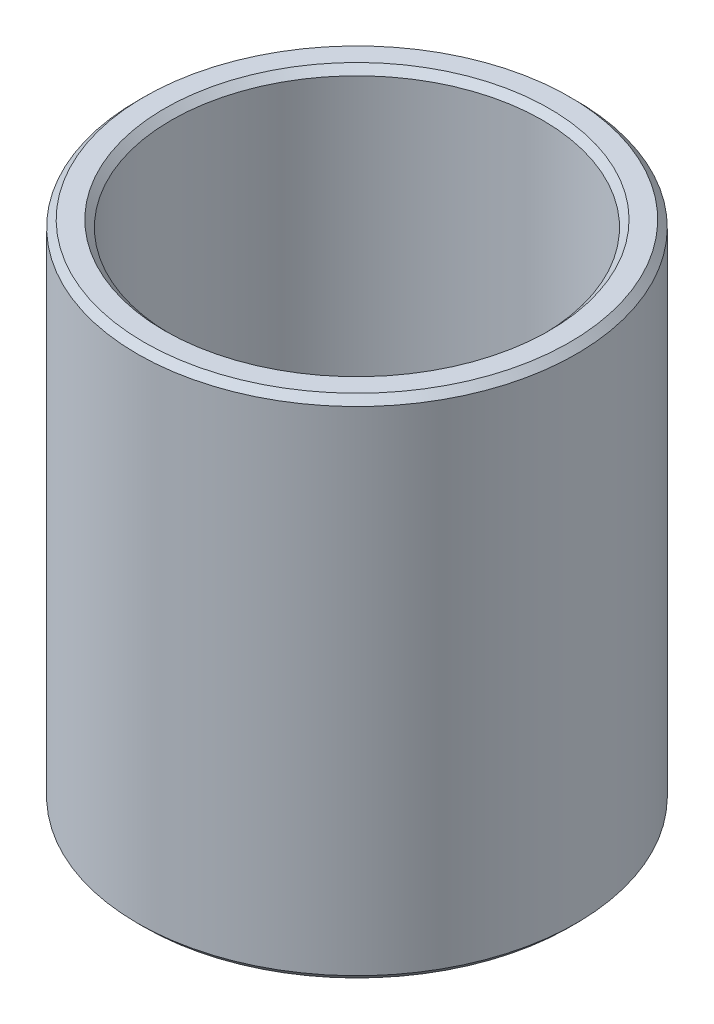
ISO-10303-21;
HEADER;
FILE_DESCRIPTION(('STEP AP214'),'2;1');
FILE_NAME('part.step','',(''),(''),'','','');
FILE_SCHEMA(('AUTOMOTIVE_DESIGN { 1 0 10303 214 1 1 1 1 }'));
ENDSEC;
DATA;
#1=APPLICATION_CONTEXT('core data for automotive mechanical design processes');
#2=APPLICATION_PROTOCOL_DEFINITION('international standard','automotive_design',2000,#1);
#3=PRODUCT_CONTEXT('',#1,'mechanical');
#4=PRODUCT('Part','Part','',(#3));
#5=PRODUCT_RELATED_PRODUCT_CATEGORY('part','',(#4));
#6=PRODUCT_DEFINITION_FORMATION('','',#4);
#7=PRODUCT_DEFINITION_CONTEXT('part definition',#1,'design');
#8=PRODUCT_DEFINITION('design','',#6,#7);
#9=PRODUCT_DEFINITION_SHAPE('','',#8);
#10=(LENGTH_UNIT() NAMED_UNIT(*) SI_UNIT(.MILLI.,.METRE.));
#11=(NAMED_UNIT(*) PLANE_ANGLE_UNIT() SI_UNIT($,.RADIAN.));
#12=(NAMED_UNIT(*) SI_UNIT($,.STERADIAN.) SOLID_ANGLE_UNIT());
#13=UNCERTAINTY_MEASURE_WITH_UNIT(LENGTH_MEASURE(1.E-05),#10,'distance_accuracy_value','');
#14=(GEOMETRIC_REPRESENTATION_CONTEXT(3) GLOBAL_UNCERTAINTY_ASSIGNED_CONTEXT((#13)) GLOBAL_UNIT_ASSIGNED_CONTEXT((#10,
#11,#12)) REPRESENTATION_CONTEXT('',''));
#15=CARTESIAN_POINT('',(0.,0.,0.));
#16=DIRECTION('',(0.,0.,1.));
#17=DIRECTION('',(1.,0.,0.));
#18=AXIS2_PLACEMENT_3D('',#15,#16,#17);
#19=CARTESIAN_POINT('',(0.,15.,0.));
#20=DIRECTION('',(0.,-1.,0.));
#21=DIRECTION('',(0.,0.,-1.));
#22=AXIS2_PLACEMENT_3D('',#19,#20,#21);
#23=CYLINDRICAL_SURFACE('',#22,5.5);
#24=CARTESIAN_POINT('',(0.,0.200000000000001,0.));
#25=DIRECTION('',(0.,1.,0.));
#26=DIRECTION('',(0.,0.,1.));
#27=AXIS2_PLACEMENT_3D('',#24,#25,#26);
#28=CIRCLE('',#27,5.5);
#29=CARTESIAN_POINT('',(0.,0.200000000000001,5.5));
#30=VERTEX_POINT('',#29);
#31=EDGE_CURVE('E42',#30,#30,#28,.F.);
#32=ORIENTED_EDGE('',*,*,#31,.T.);
#33=EDGE_LOOP('',(#32));
#34=FACE_BOUND('',#33,.T.);
#35=CARTESIAN_POINT('',(0.,14.8,0.));
#36=DIRECTION('',(0.,1.,0.));
#37=DIRECTION('',(0.,0.,1.));
#38=AXIS2_PLACEMENT_3D('',#35,#36,#37);
#39=CIRCLE('',#38,5.5);
#40=CARTESIAN_POINT('',(0.,14.8,5.5));
#41=VERTEX_POINT('',#40);
#42=EDGE_CURVE('E46',#41,#41,#39,.T.);
#43=ORIENTED_EDGE('',*,*,#42,.T.);
#44=EDGE_LOOP('',(#43));
#45=FACE_BOUND('',#44,.T.);
#46=ADVANCED_FACE('F31',(#34,#45),#23,.F.);
#47=CARTESIAN_POINT('',(0.,15.,0.));
#48=DIRECTION('',(0.,-1.,0.));
#49=DIRECTION('',(0.,0.,-1.));
#50=AXIS2_PLACEMENT_3D('',#47,#48,#49);
#51=CYLINDRICAL_SURFACE('',#50,6.5);
#52=CARTESIAN_POINT('',(0.,0.199999999999994,0.));
#53=DIRECTION('',(0.,1.,0.));
#54=DIRECTION('',(0.,0.,1.));
#55=AXIS2_PLACEMENT_3D('',#52,#53,#54);
#56=CIRCLE('',#55,6.5);
#57=CARTESIAN_POINT('',(0.,0.199999999999994,6.5));
#58=VERTEX_POINT('',#57);
#59=EDGE_CURVE('E57',#58,#58,#56,.T.);
#60=ORIENTED_EDGE('',*,*,#59,.T.);
#61=EDGE_LOOP('',(#60));
#62=FACE_BOUND('',#61,.T.);
#63=CARTESIAN_POINT('',(0.,14.8,0.));
#64=DIRECTION('',(0.,1.,0.));
#65=DIRECTION('',(0.,0.,1.));
#66=AXIS2_PLACEMENT_3D('',#63,#64,#65);
#67=CIRCLE('',#66,6.5);
#68=CARTESIAN_POINT('',(0.,14.8,6.5));
#69=VERTEX_POINT('',#68);
#70=EDGE_CURVE('E60',#69,#69,#67,.F.);
#71=ORIENTED_EDGE('',*,*,#70,.T.);
#72=EDGE_LOOP('',(#71));
#73=FACE_BOUND('',#72,.T.);
#74=ADVANCED_FACE('F64',(#62,#73),#51,.T.);
#75=CARTESIAN_POINT('',(0.,15.,0.));
#76=DIRECTION('',(0.,1.,0.));
#77=DIRECTION('',(0.,0.,1.));
#78=AXIS2_PLACEMENT_3D('',#75,#76,#77);
#79=PLANE('',#78);
#80=CARTESIAN_POINT('',(0.,15.,0.));
#81=DIRECTION('',(0.,1.,0.));
#82=DIRECTION('',(0.,0.,1.));
#83=AXIS2_PLACEMENT_3D('',#80,#81,#82);
#84=CIRCLE('',#83,6.3);
#85=CARTESIAN_POINT('',(0.,15.,6.3));
#86=VERTEX_POINT('',#85);
#87=EDGE_CURVE('E10',#86,#86,#84,.T.);
#88=ORIENTED_EDGE('',*,*,#87,.T.);
#89=EDGE_LOOP('',(#88));
#90=FACE_BOUND('',#89,.T.);
#91=CARTESIAN_POINT('',(0.,15.,0.));
#92=DIRECTION('',(0.,1.,0.));
#93=DIRECTION('',(0.,0.,1.));
#94=AXIS2_PLACEMENT_3D('',#91,#92,#93);
#95=CIRCLE('',#94,5.7);
#96=CARTESIAN_POINT('',(0.,15.,5.7));
#97=VERTEX_POINT('',#96);
#98=EDGE_CURVE('E38',#97,#97,#95,.F.);
#99=ORIENTED_EDGE('',*,*,#98,.T.);
#100=EDGE_LOOP('',(#99));
#101=FACE_BOUND('',#100,.T.);
#102=ADVANCED_FACE('F84',(#90,#101),#79,.T.);
#103=CARTESIAN_POINT('',(0.,0.,0.));
#104=DIRECTION('',(0.,1.,0.));
#105=DIRECTION('',(0.,0.,1.));
#106=AXIS2_PLACEMENT_3D('',#103,#104,#105);
#107=PLANE('',#106);
#108=CARTESIAN_POINT('',(0.,0.,0.));
#109=DIRECTION('',(0.,1.,0.));
#110=DIRECTION('',(0.,0.,1.));
#111=AXIS2_PLACEMENT_3D('',#108,#109,#110);
#112=CIRCLE('',#111,6.30000000000001);
#113=CARTESIAN_POINT('',(0.,0.,6.30000000000001));
#114=VERTEX_POINT('',#113);
#115=EDGE_CURVE('E51',#114,#114,#112,.F.);
#116=ORIENTED_EDGE('',*,*,#115,.T.);
#117=EDGE_LOOP('',(#116));
#118=FACE_BOUND('',#117,.T.);
#119=CARTESIAN_POINT('',(0.,0.,0.));
#120=DIRECTION('',(0.,1.,0.));
#121=DIRECTION('',(0.,0.,1.));
#122=AXIS2_PLACEMENT_3D('',#119,#120,#121);
#123=CIRCLE('',#122,5.7);
#124=CARTESIAN_POINT('',(0.,0.,5.7));
#125=VERTEX_POINT('',#124);
#126=EDGE_CURVE('E54',#125,#125,#123,.T.);
#127=ORIENTED_EDGE('',*,*,#126,.T.);
#128=EDGE_LOOP('',(#127));
#129=FACE_BOUND('',#128,.T.);
#130=ADVANCED_FACE('F91',(#118,#129),#107,.F.);
#131=CARTESIAN_POINT('',(0.,0.199999999999994,0.));
#132=DIRECTION('',(0.,1.,0.));
#133=DIRECTION('',(0.,0.,1.));
#134=AXIS2_PLACEMENT_3D('',#131,#132,#133);
#135=CONICAL_SURFACE('',#134,6.5,0.785398163397448);
#136=ORIENTED_EDGE('',*,*,#115,.F.);
#137=EDGE_LOOP('',(#136));
#138=FACE_BOUND('',#137,.T.);
#139=ORIENTED_EDGE('',*,*,#59,.F.);
#140=EDGE_LOOP('',(#139));
#141=FACE_BOUND('',#140,.T.);
#142=ADVANCED_FACE('F75',(#138,#141),#135,.T.);
#143=CARTESIAN_POINT('',(0.,0.,0.));
#144=DIRECTION('',(0.,-1.,0.));
#145=DIRECTION('',(0.,0.,-1.));
#146=AXIS2_PLACEMENT_3D('',#143,#144,#145);
#147=CONICAL_SURFACE('',#146,5.7,0.785398163397448);
#148=ORIENTED_EDGE('',*,*,#31,.F.);
#149=EDGE_LOOP('',(#148));
#150=FACE_BOUND('',#149,.T.);
#151=ORIENTED_EDGE('',*,*,#126,.F.);
#152=EDGE_LOOP('',(#151));
#153=FACE_BOUND('',#152,.T.);
#154=ADVANCED_FACE('F69',(#150,#153),#147,.F.);
#155=CARTESIAN_POINT('',(0.,15.,0.));
#156=DIRECTION('',(0.,-1.,0.));
#157=DIRECTION('',(0.,0.,-1.));
#158=AXIS2_PLACEMENT_3D('',#155,#156,#157);
#159=CONICAL_SURFACE('',#158,6.3,0.785398163397446);
#160=ORIENTED_EDGE('',*,*,#70,.F.);
#161=EDGE_LOOP('',(#160));
#162=FACE_BOUND('',#161,.T.);
#163=ORIENTED_EDGE('',*,*,#87,.F.);
#164=EDGE_LOOP('',(#163));
#165=FACE_BOUND('',#164,.T.);
#166=ADVANCED_FACE('F66',(#162,#165),#159,.T.);
#167=CARTESIAN_POINT('',(0.,14.8,0.));
#168=DIRECTION('',(0.,1.,0.));
#169=DIRECTION('',(0.,0.,1.));
#170=AXIS2_PLACEMENT_3D('',#167,#168,#169);
#171=CONICAL_SURFACE('',#170,5.5,0.785398163397444);
#172=ORIENTED_EDGE('',*,*,#98,.F.);
#173=EDGE_LOOP('',(#172));
#174=FACE_BOUND('',#173,.T.);
#175=ORIENTED_EDGE('',*,*,#42,.F.);
#176=EDGE_LOOP('',(#175));
#177=FACE_BOUND('',#176,.T.);
#178=ADVANCED_FACE('F33',(#174,#177),#171,.F.);
#179=CLOSED_SHELL('',(#46,#74,#102,#130,#142,#154,#166,#178));
#180=MANIFOLD_SOLID_BREP('B2',#179);
#181=ADVANCED_BREP_SHAPE_REPRESENTATION('',(#18,#180),#14);
#182=SHAPE_DEFINITION_REPRESENTATION(#9,#181);
ENDSEC;
END-ISO-10303-21;
